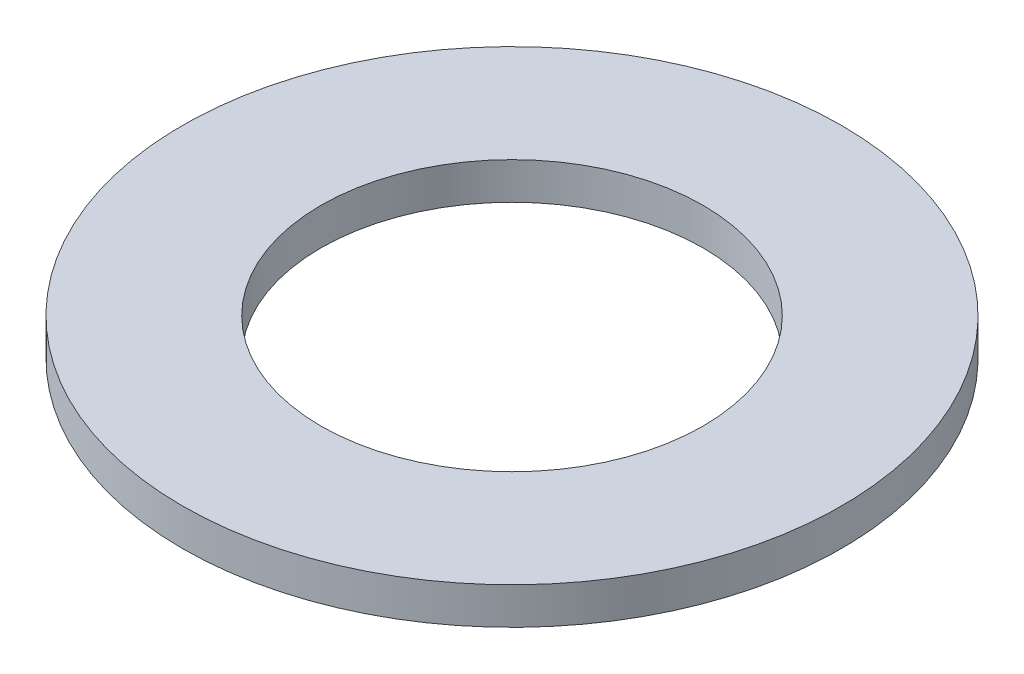
ISO-10303-21;
HEADER;
FILE_DESCRIPTION(('STEP AP214'),'2;1');
FILE_NAME('part.step','',(''),(''),'','','');
FILE_SCHEMA(('AUTOMOTIVE_DESIGN { 1 0 10303 214 1 1 1 1 }'));
ENDSEC;
DATA;
#1=APPLICATION_CONTEXT('core data for automotive mechanical design processes');
#2=APPLICATION_PROTOCOL_DEFINITION('international standard','automotive_design',2000,#1);
#3=PRODUCT_CONTEXT('',#1,'mechanical');
#4=PRODUCT('Part','Part','',(#3));
#5=PRODUCT_RELATED_PRODUCT_CATEGORY('part','',(#4));
#6=PRODUCT_DEFINITION_FORMATION('','',#4);
#7=PRODUCT_DEFINITION_CONTEXT('part definition',#1,'design');
#8=PRODUCT_DEFINITION('design','',#6,#7);
#9=PRODUCT_DEFINITION_SHAPE('','',#8);
#10=(LENGTH_UNIT() NAMED_UNIT(*) SI_UNIT(.MILLI.,.METRE.));
#11=(NAMED_UNIT(*) PLANE_ANGLE_UNIT() SI_UNIT($,.RADIAN.));
#12=(NAMED_UNIT(*) SI_UNIT($,.STERADIAN.) SOLID_ANGLE_UNIT());
#13=UNCERTAINTY_MEASURE_WITH_UNIT(LENGTH_MEASURE(1.E-05),#10,'distance_accuracy_value','');
#14=(GEOMETRIC_REPRESENTATION_CONTEXT(3) GLOBAL_UNCERTAINTY_ASSIGNED_CONTEXT((#13)) GLOBAL_UNIT_ASSIGNED_CONTEXT((#10,
#11,#12)) REPRESENTATION_CONTEXT('',''));
#15=CARTESIAN_POINT('',(0.,0.,0.));
#16=DIRECTION('',(0.,0.,1.));
#17=DIRECTION('',(1.,0.,0.));
#18=AXIS2_PLACEMENT_3D('',#15,#16,#17);
#19=CARTESIAN_POINT('',(0.,2.4892,0.));
#20=DIRECTION('',(0.,-1.,0.));
#21=DIRECTION('',(0.,0.,-1.));
#22=AXIS2_PLACEMENT_3D('',#19,#20,#21);
#23=CYLINDRICAL_SURFACE('',#22,22.225);
#24=CARTESIAN_POINT('',(0.,2.4892,0.));
#25=DIRECTION('',(0.,1.,0.));
#26=DIRECTION('',(0.,0.,1.));
#27=AXIS2_PLACEMENT_3D('',#24,#25,#26);
#28=CIRCLE('',#27,22.225);
#29=CARTESIAN_POINT('',(0.,2.4892,22.225));
#30=VERTEX_POINT('',#29);
#31=EDGE_CURVE('E10',#30,#30,#28,.T.);
#32=ORIENTED_EDGE('',*,*,#31,.F.);
#33=EDGE_LOOP('',(#32));
#34=FACE_BOUND('',#33,.T.);
#35=CARTESIAN_POINT('',(0.,0.,0.));
#36=DIRECTION('',(0.,1.,0.));
#37=DIRECTION('',(0.,0.,1.));
#38=AXIS2_PLACEMENT_3D('',#35,#36,#37);
#39=CIRCLE('',#38,22.225);
#40=CARTESIAN_POINT('',(0.,0.,22.225));
#41=VERTEX_POINT('',#40);
#42=EDGE_CURVE('E36',#41,#41,#39,.T.);
#43=ORIENTED_EDGE('',*,*,#42,.T.);
#44=EDGE_LOOP('',(#43));
#45=FACE_BOUND('',#44,.T.);
#46=ADVANCED_FACE('F33',(#34,#45),#23,.T.);
#47=CARTESIAN_POINT('',(0.,2.4892,0.));
#48=DIRECTION('',(0.,1.,0.));
#49=DIRECTION('',(0.,0.,1.));
#50=AXIS2_PLACEMENT_3D('',#47,#48,#49);
#51=PLANE('',#50);
#52=CARTESIAN_POINT('',(0.,2.4892,0.));
#53=DIRECTION('',(0.,1.,0.));
#54=DIRECTION('',(0.,0.,1.));
#55=AXIS2_PLACEMENT_3D('',#52,#53,#54);
#56=CIRCLE('',#55,12.8905);
#57=CARTESIAN_POINT('',(0.,2.4892,12.8905));
#58=VERTEX_POINT('',#57);
#59=EDGE_CURVE('E45',#58,#58,#56,.T.);
#60=ORIENTED_EDGE('',*,*,#59,.F.);
#61=EDGE_LOOP('',(#60));
#62=FACE_BOUND('',#61,.T.);
#63=ORIENTED_EDGE('',*,*,#31,.T.);
#64=EDGE_LOOP('',(#63));
#65=FACE_BOUND('',#64,.T.);
#66=ADVANCED_FACE('F60',(#62,#65),#51,.T.);
#67=CARTESIAN_POINT('',(0.,0.,0.));
#68=DIRECTION('',(0.,1.,0.));
#69=DIRECTION('',(0.,0.,1.));
#70=AXIS2_PLACEMENT_3D('',#67,#68,#69);
#71=PLANE('',#70);
#72=CARTESIAN_POINT('',(0.,0.,0.));
#73=DIRECTION('',(0.,1.,0.));
#74=DIRECTION('',(0.,0.,1.));
#75=AXIS2_PLACEMENT_3D('',#72,#73,#74);
#76=CIRCLE('',#75,12.8905);
#77=CARTESIAN_POINT('',(0.,0.,12.8905));
#78=VERTEX_POINT('',#77);
#79=EDGE_CURVE('E43',#78,#78,#76,.T.);
#80=ORIENTED_EDGE('',*,*,#79,.T.);
#81=EDGE_LOOP('',(#80));
#82=FACE_BOUND('',#81,.T.);
#83=ORIENTED_EDGE('',*,*,#42,.F.);
#84=EDGE_LOOP('',(#83));
#85=FACE_BOUND('',#84,.T.);
#86=ADVANCED_FACE('F51',(#82,#85),#71,.F.);
#87=CARTESIAN_POINT('',(0.,0.,0.));
#88=DIRECTION('',(0.,1.,0.));
#89=DIRECTION('',(0.,0.,1.));
#90=AXIS2_PLACEMENT_3D('',#87,#88,#89);
#91=CYLINDRICAL_SURFACE('',#90,12.8905);
#92=ORIENTED_EDGE('',*,*,#79,.F.);
#93=EDGE_LOOP('',(#92));
#94=FACE_BOUND('',#93,.T.);
#95=ORIENTED_EDGE('',*,*,#59,.T.);
#96=EDGE_LOOP('',(#95));
#97=FACE_BOUND('',#96,.T.);
#98=ADVANCED_FACE('F54',(#94,#97),#91,.F.);
#99=CLOSED_SHELL('',(#46,#66,#86,#98));
#100=MANIFOLD_SOLID_BREP('B2',#99);
#101=ADVANCED_BREP_SHAPE_REPRESENTATION('',(#18,#100),#14);
#102=SHAPE_DEFINITION_REPRESENTATION(#9,#101);
ENDSEC;
END-ISO-10303-21;
